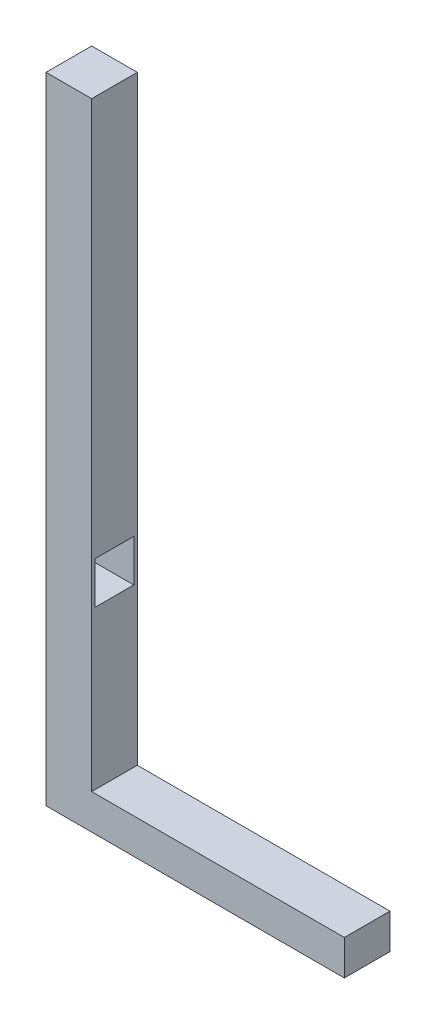
ISO-10303-21;
HEADER;
FILE_DESCRIPTION(('STEP AP214'),'2;1');
FILE_NAME('part.step','',(''),(''),'','','');
FILE_SCHEMA(('AUTOMOTIVE_DESIGN { 1 0 10303 214 1 1 1 1 }'));
ENDSEC;
DATA;
#1=APPLICATION_CONTEXT('core data for automotive mechanical design processes');
#2=APPLICATION_PROTOCOL_DEFINITION('international standard','automotive_design',2000,#1);
#3=PRODUCT_CONTEXT('',#1,'mechanical');
#4=PRODUCT('Part','Part','',(#3));
#5=PRODUCT_RELATED_PRODUCT_CATEGORY('part','',(#4));
#6=PRODUCT_DEFINITION_FORMATION('','',#4);
#7=PRODUCT_DEFINITION_CONTEXT('part definition',#1,'design');
#8=PRODUCT_DEFINITION('design','',#6,#7);
#9=PRODUCT_DEFINITION_SHAPE('','',#8);
#10=(LENGTH_UNIT() NAMED_UNIT(*) SI_UNIT(.MILLI.,.METRE.));
#11=(NAMED_UNIT(*) PLANE_ANGLE_UNIT() SI_UNIT($,.RADIAN.));
#12=(NAMED_UNIT(*) SI_UNIT($,.STERADIAN.) SOLID_ANGLE_UNIT());
#13=UNCERTAINTY_MEASURE_WITH_UNIT(LENGTH_MEASURE(1.E-05),#10,'distance_accuracy_value','');
#14=(GEOMETRIC_REPRESENTATION_CONTEXT(3) GLOBAL_UNCERTAINTY_ASSIGNED_CONTEXT((#13)) GLOBAL_UNIT_ASSIGNED_CONTEXT((#10,
#11,#12)) REPRESENTATION_CONTEXT('',''));
#15=CARTESIAN_POINT('',(0.,0.,0.));
#16=DIRECTION('',(0.,0.,1.));
#17=DIRECTION('',(1.,0.,0.));
#18=AXIS2_PLACEMENT_3D('',#15,#16,#17);
#19=CARTESIAN_POINT('',(-58.3353622987114,181.,13.));
#20=DIRECTION('',(1.,0.,0.));
#21=DIRECTION('',(0.,1.,0.));
#22=AXIS2_PLACEMENT_3D('',#19,#20,#21);
#23=PLANE('',#22);
#24=DIRECTION('',(0.,-1.,0.));
#25=VECTOR('',#24,1.);
#26=CARTESIAN_POINT('',(-58.3353622987114,67.,12.));
#27=LINE('',#26,#25);
#28=CARTESIAN_POINT('',(-58.3353622987114,67.,12.));
#29=VERTEX_POINT('',#28);
#30=CARTESIAN_POINT('',(-58.3353622987114,55.,12.));
#31=VERTEX_POINT('',#30);
#32=EDGE_CURVE('E49',#29,#31,#27,.T.);
#33=ORIENTED_EDGE('',*,*,#32,.F.);
#34=DIRECTION('',(0.,0.,1.));
#35=VECTOR('',#34,1.);
#36=CARTESIAN_POINT('',(-58.3353622987114,67.,12.));
#37=LINE('',#36,#35);
#38=CARTESIAN_POINT('',(-58.3353622987114,67.,0.999999999999999));
#39=VERTEX_POINT('',#38);
#40=EDGE_CURVE('E129',#39,#29,#37,.T.);
#41=ORIENTED_EDGE('',*,*,#40,.F.);
#42=DIRECTION('',(0.,1.,0.));
#43=VECTOR('',#42,1.);
#44=CARTESIAN_POINT('',(-58.3353622987114,67.,0.999999999999999));
#45=LINE('',#44,#43);
#46=CARTESIAN_POINT('',(-58.3353622987114,55.,0.999999999999999));
#47=VERTEX_POINT('',#46);
#48=EDGE_CURVE('E114',#47,#39,#45,.T.);
#49=ORIENTED_EDGE('',*,*,#48,.F.);
#50=DIRECTION('',(0.,0.,-1.));
#51=VECTOR('',#50,1.);
#52=CARTESIAN_POINT('',(-58.3353622987114,55.,12.));
#53=LINE('',#52,#51);
#54=EDGE_CURVE('E123',#31,#47,#53,.T.);
#55=ORIENTED_EDGE('',*,*,#54,.F.);
#56=EDGE_LOOP('',(#33,#41,#49,#55));
#57=FACE_BOUND('',#56,.T.);
#58=DIRECTION('',(0.,-1.,0.));
#59=VECTOR('',#58,1.);
#60=CARTESIAN_POINT('',(-58.3353622987114,181.,0.));
#61=LINE('',#60,#59);
#62=CARTESIAN_POINT('',(-58.3353622987114,181.,0.));
#63=VERTEX_POINT('',#62);
#64=CARTESIAN_POINT('',(-58.3353622987114,9.99999999999998,0.));
#65=VERTEX_POINT('',#64);
#66=EDGE_CURVE('E165',#63,#65,#61,.T.);
#67=ORIENTED_EDGE('',*,*,#66,.F.);
#68=DIRECTION('',(0.,0.,-1.));
#69=VECTOR('',#68,1.);
#70=CARTESIAN_POINT('',(-58.3353622987114,181.,13.));
#71=LINE('',#70,#69);
#72=CARTESIAN_POINT('',(-58.3353622987114,181.,13.));
#73=VERTEX_POINT('',#72);
#74=EDGE_CURVE('E168',#73,#63,#71,.T.);
#75=ORIENTED_EDGE('',*,*,#74,.F.);
#76=DIRECTION('',(0.,-1.,0.));
#77=VECTOR('',#76,1.);
#78=CARTESIAN_POINT('',(-58.3353622987114,181.,13.));
#79=LINE('',#78,#77);
#80=CARTESIAN_POINT('',(-58.3353622987114,9.99999999999998,13.));
#81=VERTEX_POINT('',#80);
#82=EDGE_CURVE('E158',#73,#81,#79,.T.);
#83=ORIENTED_EDGE('',*,*,#82,.T.);
#84=DIRECTION('',(0.,0.,-1.));
#85=VECTOR('',#84,1.);
#86=CARTESIAN_POINT('',(-58.3353622987114,9.99999999999998,13.));
#87=LINE('',#86,#85);
#88=EDGE_CURVE('E170',#81,#65,#87,.T.);
#89=ORIENTED_EDGE('',*,*,#88,.T.);
#90=EDGE_LOOP('',(#67,#75,#83,#89));
#91=FACE_BOUND('',#90,.T.);
#92=ADVANCED_FACE('F35',(#57,#91),#23,.T.);
#93=CARTESIAN_POINT('',(-71.3353622987114,181.,13.));
#94=DIRECTION('',(0.,1.,0.));
#95=DIRECTION('',(0.,0.,1.));
#96=AXIS2_PLACEMENT_3D('',#93,#94,#95);
#97=PLANE('',#96);
#98=DIRECTION('',(1.,0.,0.));
#99=VECTOR('',#98,1.);
#100=CARTESIAN_POINT('',(-71.3353622987114,181.,0.));
#101=LINE('',#100,#99);
#102=CARTESIAN_POINT('',(-71.3353622987114,181.,0.));
#103=VERTEX_POINT('',#102);
#104=EDGE_CURVE('E161',#103,#63,#101,.T.);
#105=ORIENTED_EDGE('',*,*,#104,.F.);
#106=DIRECTION('',(0.,0.,-1.));
#107=VECTOR('',#106,1.);
#108=CARTESIAN_POINT('',(-71.3353622987114,181.,13.));
#109=LINE('',#108,#107);
#110=CARTESIAN_POINT('',(-71.3353622987114,181.,13.));
#111=VERTEX_POINT('',#110);
#112=EDGE_CURVE('E160',#111,#103,#109,.T.);
#113=ORIENTED_EDGE('',*,*,#112,.F.);
#114=DIRECTION('',(1.,0.,0.));
#115=VECTOR('',#114,1.);
#116=CARTESIAN_POINT('',(-71.3353622987114,181.,13.));
#117=LINE('',#116,#115);
#118=EDGE_CURVE('E154',#111,#73,#117,.T.);
#119=ORIENTED_EDGE('',*,*,#118,.T.);
#120=ORIENTED_EDGE('',*,*,#74,.T.);
#121=EDGE_LOOP('',(#105,#113,#119,#120));
#122=FACE_BOUND('',#121,.T.);
#123=ADVANCED_FACE('F207',(#122),#97,.T.);
#124=CARTESIAN_POINT('',(-71.3353622987114,181.,13.));
#125=DIRECTION('',(1.,0.,0.));
#126=DIRECTION('',(0.,1.,0.));
#127=AXIS2_PLACEMENT_3D('',#124,#125,#126);
#128=PLANE('',#127);
#129=DIRECTION('',(0.,0.,1.));
#130=VECTOR('',#129,1.);
#131=CARTESIAN_POINT('',(-71.3353622987114,67.,13.));
#132=LINE('',#131,#130);
#133=CARTESIAN_POINT('',(-71.3353622987114,67.,0.999999999999999));
#134=VERTEX_POINT('',#133);
#135=CARTESIAN_POINT('',(-71.3353622987114,67.,12.));
#136=VERTEX_POINT('',#135);
#137=EDGE_CURVE('E42',#134,#136,#132,.T.);
#138=ORIENTED_EDGE('',*,*,#137,.T.);
#139=DIRECTION('',(0.,-1.,0.));
#140=VECTOR('',#139,1.);
#141=CARTESIAN_POINT('',(-71.3353622987114,181.,12.));
#142=LINE('',#141,#140);
#143=CARTESIAN_POINT('',(-71.3353622987114,55.,12.));
#144=VERTEX_POINT('',#143);
#145=EDGE_CURVE('E11',#136,#144,#142,.T.);
#146=ORIENTED_EDGE('',*,*,#145,.T.);
#147=DIRECTION('',(0.,0.,-1.));
#148=VECTOR('',#147,1.);
#149=CARTESIAN_POINT('',(-71.3353622987114,55.,13.));
#150=LINE('',#149,#148);
#151=CARTESIAN_POINT('',(-71.3353622987114,55.,0.999999999999999));
#152=VERTEX_POINT('',#151);
#153=EDGE_CURVE('E175',#144,#152,#150,.T.);
#154=ORIENTED_EDGE('',*,*,#153,.T.);
#155=DIRECTION('',(0.,1.,0.));
#156=VECTOR('',#155,1.);
#157=CARTESIAN_POINT('',(-71.3353622987114,181.,0.999999999999999));
#158=LINE('',#157,#156);
#159=EDGE_CURVE('E117',#152,#134,#158,.T.);
#160=ORIENTED_EDGE('',*,*,#159,.T.);
#161=EDGE_LOOP('',(#138,#146,#154,#160));
#162=FACE_BOUND('',#161,.T.);
#163=DIRECTION('',(0.,-1.,0.));
#164=VECTOR('',#163,1.);
#165=CARTESIAN_POINT('',(-71.3353622987114,181.,0.));
#166=LINE('',#165,#164);
#167=CARTESIAN_POINT('',(-71.3353622987114,0.,0.));
#168=VERTEX_POINT('',#167);
#169=EDGE_CURVE('E164',#103,#168,#166,.T.);
#170=ORIENTED_EDGE('',*,*,#169,.T.);
#171=DIRECTION('',(0.,0.,-1.));
#172=VECTOR('',#171,1.);
#173=CARTESIAN_POINT('',(-71.3353622987114,0.,13.));
#174=LINE('',#173,#172);
#175=CARTESIAN_POINT('',(-71.3353622987114,0.,13.));
#176=VERTEX_POINT('',#175);
#177=EDGE_CURVE('E246',#176,#168,#174,.T.);
#178=ORIENTED_EDGE('',*,*,#177,.F.);
#179=DIRECTION('',(0.,-1.,0.));
#180=VECTOR('',#179,1.);
#181=CARTESIAN_POINT('',(-71.3353622987114,181.,13.));
#182=LINE('',#181,#180);
#183=EDGE_CURVE('E157',#111,#176,#182,.T.);
#184=ORIENTED_EDGE('',*,*,#183,.F.);
#185=ORIENTED_EDGE('',*,*,#112,.T.);
#186=EDGE_LOOP('',(#170,#178,#184,#185));
#187=FACE_BOUND('',#186,.T.);
#188=ADVANCED_FACE('F188',(#162,#187),#128,.F.);
#189=CARTESIAN_POINT('',(0.,0.,13.));
#190=DIRECTION('',(0.,0.,-1.));
#191=DIRECTION('',(-1.,0.,0.));
#192=AXIS2_PLACEMENT_3D('',#189,#190,#191);
#193=PLANE('',#192);
#194=ORIENTED_EDGE('',*,*,#183,.T.);
#195=DIRECTION('',(1.,0.,0.));
#196=VECTOR('',#195,1.);
#197=CARTESIAN_POINT('',(0.,0.,13.));
#198=LINE('',#197,#196);
#199=CARTESIAN_POINT('',(13.6646377012886,0.,13.));
#200=VERTEX_POINT('',#199);
#201=EDGE_CURVE('E146',#176,#200,#198,.T.);
#202=ORIENTED_EDGE('',*,*,#201,.T.);
#203=DIRECTION('',(0.,-1.,0.));
#204=VECTOR('',#203,1.);
#205=CARTESIAN_POINT('',(13.6646377012886,0.,13.));
#206=LINE('',#205,#204);
#207=CARTESIAN_POINT('',(13.6646377012886,9.99999999999998,13.));
#208=VERTEX_POINT('',#207);
#209=EDGE_CURVE('E139',#208,#200,#206,.T.);
#210=ORIENTED_EDGE('',*,*,#209,.F.);
#211=DIRECTION('',(1.,0.,0.));
#212=VECTOR('',#211,1.);
#213=CARTESIAN_POINT('',(0.,9.99999999999998,13.));
#214=LINE('',#213,#212);
#215=EDGE_CURVE('E142',#81,#208,#214,.T.);
#216=ORIENTED_EDGE('',*,*,#215,.F.);
#217=ORIENTED_EDGE('',*,*,#82,.F.);
#218=ORIENTED_EDGE('',*,*,#118,.F.);
#219=EDGE_LOOP('',(#194,#202,#210,#216,#217,#218));
#220=FACE_BOUND('',#219,.T.);
#221=ADVANCED_FACE('F215',(#220),#193,.F.);
#222=CARTESIAN_POINT('',(0.,0.,0.));
#223=DIRECTION('',(0.,0.,-1.));
#224=DIRECTION('',(-1.,0.,0.));
#225=AXIS2_PLACEMENT_3D('',#222,#223,#224);
#226=PLANE('',#225);
#227=ORIENTED_EDGE('',*,*,#66,.T.);
#228=DIRECTION('',(1.,0.,0.));
#229=VECTOR('',#228,1.);
#230=CARTESIAN_POINT('',(0.,9.99999999999998,0.));
#231=LINE('',#230,#229);
#232=CARTESIAN_POINT('',(13.6646377012886,9.99999999999998,0.));
#233=VERTEX_POINT('',#232);
#234=EDGE_CURVE('E151',#65,#233,#231,.T.);
#235=ORIENTED_EDGE('',*,*,#234,.T.);
#236=DIRECTION('',(0.,-1.,0.));
#237=VECTOR('',#236,1.);
#238=CARTESIAN_POINT('',(13.6646377012886,0.,0.));
#239=LINE('',#238,#237);
#240=CARTESIAN_POINT('',(13.6646377012886,0.,0.));
#241=VERTEX_POINT('',#240);
#242=EDGE_CURVE('E136',#233,#241,#239,.T.);
#243=ORIENTED_EDGE('',*,*,#242,.T.);
#244=DIRECTION('',(1.,0.,0.));
#245=VECTOR('',#244,1.);
#246=CARTESIAN_POINT('',(0.,0.,0.));
#247=LINE('',#246,#245);
#248=EDGE_CURVE('E143',#168,#241,#247,.T.);
#249=ORIENTED_EDGE('',*,*,#248,.F.);
#250=ORIENTED_EDGE('',*,*,#169,.F.);
#251=ORIENTED_EDGE('',*,*,#104,.T.);
#252=EDGE_LOOP('',(#227,#235,#243,#249,#250,#251));
#253=FACE_BOUND('',#252,.T.);
#254=ADVANCED_FACE('F219',(#253),#226,.T.);
#255=CARTESIAN_POINT('',(0.,9.99999999999998,13.));
#256=DIRECTION('',(0.,1.,0.));
#257=DIRECTION('',(0.,0.,1.));
#258=AXIS2_PLACEMENT_3D('',#255,#256,#257);
#259=PLANE('',#258);
#260=ORIENTED_EDGE('',*,*,#88,.F.);
#261=ORIENTED_EDGE('',*,*,#215,.T.);
#262=DIRECTION('',(0.,0.,-1.));
#263=VECTOR('',#262,1.);
#264=CARTESIAN_POINT('',(13.6646377012886,9.99999999999998,13.));
#265=LINE('',#264,#263);
#266=EDGE_CURVE('E178',#208,#233,#265,.T.);
#267=ORIENTED_EDGE('',*,*,#266,.T.);
#268=ORIENTED_EDGE('',*,*,#234,.F.);
#269=EDGE_LOOP('',(#260,#261,#267,#268));
#270=FACE_BOUND('',#269,.T.);
#271=ADVANCED_FACE('F222',(#270),#259,.T.);
#272=CARTESIAN_POINT('',(13.6646377012886,0.,13.));
#273=DIRECTION('',(1.,0.,0.));
#274=DIRECTION('',(0.,0.,-1.));
#275=AXIS2_PLACEMENT_3D('',#272,#273,#274);
#276=PLANE('',#275);
#277=ORIENTED_EDGE('',*,*,#242,.F.);
#278=ORIENTED_EDGE('',*,*,#266,.F.);
#279=ORIENTED_EDGE('',*,*,#209,.T.);
#280=DIRECTION('',(0.,0.,-1.));
#281=VECTOR('',#280,1.);
#282=CARTESIAN_POINT('',(13.6646377012886,0.,13.));
#283=LINE('',#282,#281);
#284=EDGE_CURVE('E250',#200,#241,#283,.T.);
#285=ORIENTED_EDGE('',*,*,#284,.T.);
#286=EDGE_LOOP('',(#277,#278,#279,#285));
#287=FACE_BOUND('',#286,.T.);
#288=ADVANCED_FACE('F202',(#287),#276,.T.);
#289=CARTESIAN_POINT('',(0.,0.,13.));
#290=DIRECTION('',(0.,1.,0.));
#291=DIRECTION('',(0.,0.,1.));
#292=AXIS2_PLACEMENT_3D('',#289,#290,#291);
#293=PLANE('',#292);
#294=ORIENTED_EDGE('',*,*,#248,.T.);
#295=ORIENTED_EDGE('',*,*,#284,.F.);
#296=ORIENTED_EDGE('',*,*,#201,.F.);
#297=ORIENTED_EDGE('',*,*,#177,.T.);
#298=EDGE_LOOP('',(#294,#295,#296,#297));
#299=FACE_BOUND('',#298,.T.);
#300=ADVANCED_FACE('F195',(#299),#293,.F.);
#301=CARTESIAN_POINT('',(-95.3353622987114,67.,12.));
#302=DIRECTION('',(0.,0.,1.));
#303=DIRECTION('',(1.,0.,0.));
#304=AXIS2_PLACEMENT_3D('',#301,#302,#303);
#305=PLANE('',#304);
#306=DIRECTION('',(1.,0.,0.));
#307=VECTOR('',#306,1.);
#308=CARTESIAN_POINT('',(-95.3353622987114,67.,12.));
#309=LINE('',#308,#307);
#310=EDGE_CURVE('E134',#136,#29,#309,.T.);
#311=ORIENTED_EDGE('',*,*,#310,.T.);
#312=ORIENTED_EDGE('',*,*,#32,.T.);
#313=DIRECTION('',(1.,0.,0.));
#314=VECTOR('',#313,1.);
#315=CARTESIAN_POINT('',(-95.3353622987114,55.,12.));
#316=LINE('',#315,#314);
#317=EDGE_CURVE('E120',#144,#31,#316,.T.);
#318=ORIENTED_EDGE('',*,*,#317,.F.);
#319=ORIENTED_EDGE('',*,*,#145,.F.);
#320=EDGE_LOOP('',(#311,#312,#318,#319));
#321=FACE_BOUND('',#320,.T.);
#322=ADVANCED_FACE('F193',(#321),#305,.F.);
#323=CARTESIAN_POINT('',(-95.3353622987114,67.,12.));
#324=DIRECTION('',(0.,1.,0.));
#325=DIRECTION('',(-1.,0.,0.));
#326=AXIS2_PLACEMENT_3D('',#323,#324,#325);
#327=PLANE('',#326);
#328=DIRECTION('',(1.,0.,0.));
#329=VECTOR('',#328,1.);
#330=CARTESIAN_POINT('',(-95.3353622987114,67.,0.999999999999999));
#331=LINE('',#330,#329);
#332=EDGE_CURVE('E119',#134,#39,#331,.T.);
#333=ORIENTED_EDGE('',*,*,#332,.T.);
#334=ORIENTED_EDGE('',*,*,#40,.T.);
#335=ORIENTED_EDGE('',*,*,#310,.F.);
#336=ORIENTED_EDGE('',*,*,#137,.F.);
#337=EDGE_LOOP('',(#333,#334,#335,#336));
#338=FACE_BOUND('',#337,.T.);
#339=ADVANCED_FACE('F192',(#338),#327,.F.);
#340=CARTESIAN_POINT('',(-95.3353622987114,67.,0.999999999999999));
#341=DIRECTION('',(0.,0.,-1.));
#342=DIRECTION('',(-1.,0.,0.));
#343=AXIS2_PLACEMENT_3D('',#340,#341,#342);
#344=PLANE('',#343);
#345=DIRECTION('',(1.,0.,0.));
#346=VECTOR('',#345,1.);
#347=CARTESIAN_POINT('',(-95.3353622987114,55.,0.999999999999999));
#348=LINE('',#347,#346);
#349=EDGE_CURVE('E57',#152,#47,#348,.T.);
#350=ORIENTED_EDGE('',*,*,#349,.T.);
#351=ORIENTED_EDGE('',*,*,#48,.T.);
#352=ORIENTED_EDGE('',*,*,#332,.F.);
#353=ORIENTED_EDGE('',*,*,#159,.F.);
#354=EDGE_LOOP('',(#350,#351,#352,#353));
#355=FACE_BOUND('',#354,.T.);
#356=ADVANCED_FACE('F111',(#355),#344,.F.);
#357=CARTESIAN_POINT('',(-95.3353622987114,55.,12.));
#358=DIRECTION('',(0.,-1.,0.));
#359=DIRECTION('',(1.,0.,0.));
#360=AXIS2_PLACEMENT_3D('',#357,#358,#359);
#361=PLANE('',#360);
#362=ORIENTED_EDGE('',*,*,#317,.T.);
#363=ORIENTED_EDGE('',*,*,#54,.T.);
#364=ORIENTED_EDGE('',*,*,#349,.F.);
#365=ORIENTED_EDGE('',*,*,#153,.F.);
#366=EDGE_LOOP('',(#362,#363,#364,#365));
#367=FACE_BOUND('',#366,.T.);
#368=ADVANCED_FACE('F124',(#367),#361,.F.);
#369=CLOSED_SHELL('',(#92,#123,#188,#221,#254,#271,#288,#300,#322,#339,#356,#368));
#370=MANIFOLD_SOLID_BREP('B2',#369);
#371=ADVANCED_BREP_SHAPE_REPRESENTATION('',(#18,#370),#14);
#372=SHAPE_DEFINITION_REPRESENTATION(#9,#371);
ENDSEC;
END-ISO-10303-21;
